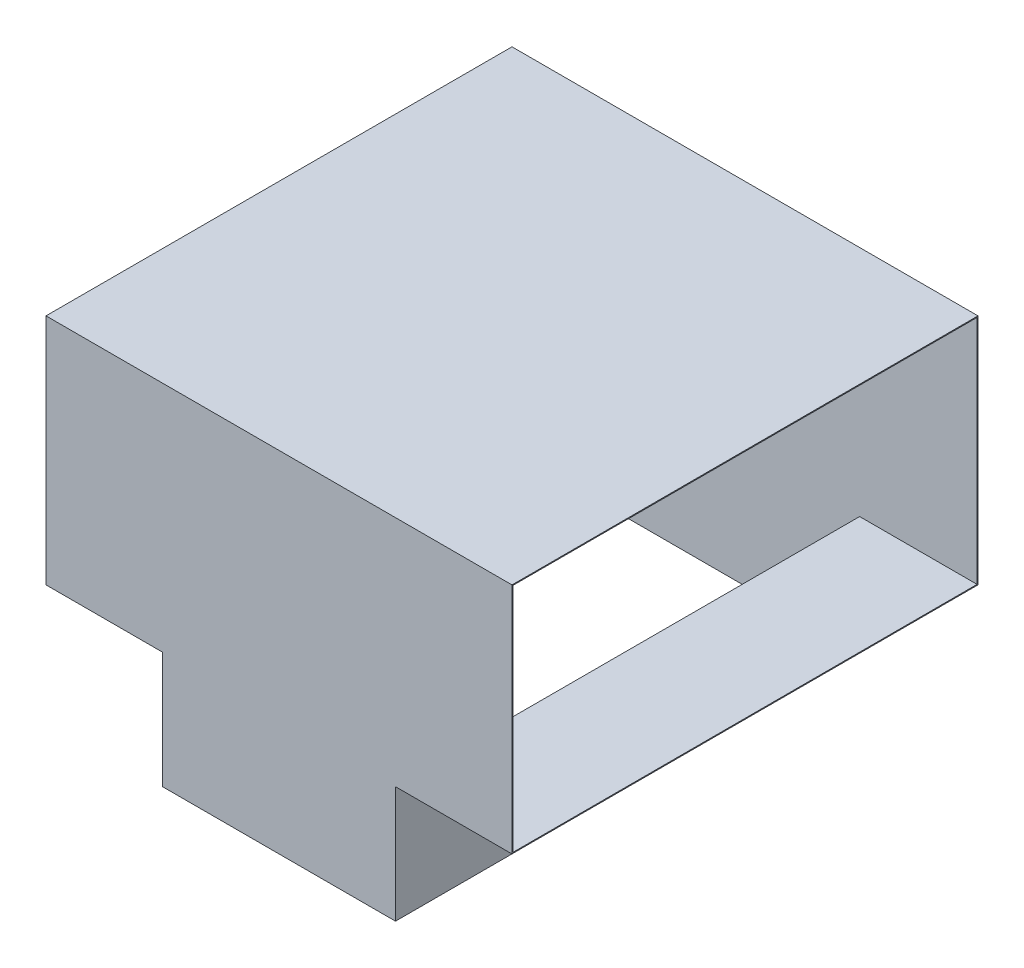
ISO-10303-21;
HEADER;
FILE_DESCRIPTION(('STEP AP214'),'2;1');
FILE_NAME('part.step','',(''),(''),'','','');
FILE_SCHEMA(('AUTOMOTIVE_DESIGN { 1 0 10303 214 1 1 1 1 }'));
ENDSEC;
DATA;
#1=APPLICATION_CONTEXT('core data for automotive mechanical design processes');
#2=APPLICATION_PROTOCOL_DEFINITION('international standard','automotive_design',2000,#1);
#3=PRODUCT_CONTEXT('',#1,'mechanical');
#4=PRODUCT('Part','Part','',(#3));
#5=PRODUCT_RELATED_PRODUCT_CATEGORY('part','',(#4));
#6=PRODUCT_DEFINITION_FORMATION('','',#4);
#7=PRODUCT_DEFINITION_CONTEXT('part definition',#1,'design');
#8=PRODUCT_DEFINITION('design','',#6,#7);
#9=PRODUCT_DEFINITION_SHAPE('','',#8);
#10=(LENGTH_UNIT() NAMED_UNIT(*) SI_UNIT(.MILLI.,.METRE.));
#11=(NAMED_UNIT(*) PLANE_ANGLE_UNIT() SI_UNIT($,.RADIAN.));
#12=(NAMED_UNIT(*) SI_UNIT($,.STERADIAN.) SOLID_ANGLE_UNIT());
#13=UNCERTAINTY_MEASURE_WITH_UNIT(LENGTH_MEASURE(1.E-05),#10,'distance_accuracy_value','');
#14=(GEOMETRIC_REPRESENTATION_CONTEXT(3) GLOBAL_UNCERTAINTY_ASSIGNED_CONTEXT((#13)) GLOBAL_UNIT_ASSIGNED_CONTEXT((#10,
#11,#12)) REPRESENTATION_CONTEXT('',''));
#15=CARTESIAN_POINT('',(0.,0.,0.));
#16=DIRECTION('',(0.,0.,1.));
#17=DIRECTION('',(1.,0.,0.));
#18=AXIS2_PLACEMENT_3D('',#15,#16,#17);
#19=CARTESIAN_POINT('',(500.,-248.,500.));
#20=DIRECTION('',(0.,1.,0.));
#21=DIRECTION('',(0.,0.,1.));
#22=AXIS2_PLACEMENT_3D('',#19,#20,#21);
#23=PLANE('',#22);
#24=DIRECTION('',(0.,0.,-1.));
#25=VECTOR('',#24,1.);
#26=CARTESIAN_POINT('',(-248.,-248.,498.));
#27=LINE('',#26,#25);
#28=CARTESIAN_POINT('',(-248.,-248.,498.));
#29=VERTEX_POINT('',#28);
#30=CARTESIAN_POINT('',(-248.,-248.,-498.));
#31=VERTEX_POINT('',#30);
#32=EDGE_CURVE('E214',#29,#31,#27,.T.);
#33=ORIENTED_EDGE('',*,*,#32,.T.);
#34=DIRECTION('',(-1.,0.,0.));
#35=VECTOR('',#34,1.);
#36=CARTESIAN_POINT('',(500.,-248.,-498.));
#37=LINE('',#36,#35);
#38=CARTESIAN_POINT('',(-500.,-248.,-498.));
#39=VERTEX_POINT('',#38);
#40=EDGE_CURVE('E334',#31,#39,#37,.T.);
#41=ORIENTED_EDGE('',*,*,#40,.T.);
#42=DIRECTION('',(0.,0.,-1.));
#43=VECTOR('',#42,1.);
#44=CARTESIAN_POINT('',(-500.,-248.,500.));
#45=LINE('',#44,#43);
#46=CARTESIAN_POINT('',(-500.,-248.,498.));
#47=VERTEX_POINT('',#46);
#48=EDGE_CURVE('E324',#47,#39,#45,.T.);
#49=ORIENTED_EDGE('',*,*,#48,.F.);
#50=DIRECTION('',(-1.,0.,0.));
#51=VECTOR('',#50,1.);
#52=CARTESIAN_POINT('',(500.,-248.,498.));
#53=LINE('',#52,#51);
#54=EDGE_CURVE('E221',#29,#47,#53,.T.);
#55=ORIENTED_EDGE('',*,*,#54,.F.);
#56=EDGE_LOOP('',(#33,#41,#49,#55));
#57=FACE_BOUND('',#56,.T.);
#58=ADVANCED_FACE('F82',(#57),#23,.T.);
#59=CARTESIAN_POINT('',(500.,-250.,500.));
#60=DIRECTION('',(0.,1.,0.));
#61=DIRECTION('',(0.,0.,1.));
#62=AXIS2_PLACEMENT_3D('',#59,#60,#61);
#63=PLANE('',#62);
#64=DIRECTION('',(0.,0.,-1.));
#65=VECTOR('',#64,1.);
#66=CARTESIAN_POINT('',(-250.,-250.,500.));
#67=LINE('',#66,#65);
#68=CARTESIAN_POINT('',(-250.,-250.,500.));
#69=VERTEX_POINT('',#68);
#70=CARTESIAN_POINT('',(-250.,-250.,-500.));
#71=VERTEX_POINT('',#70);
#72=EDGE_CURVE('E107',#69,#71,#67,.T.);
#73=ORIENTED_EDGE('',*,*,#72,.F.);
#74=DIRECTION('',(-1.,0.,0.));
#75=VECTOR('',#74,1.);
#76=CARTESIAN_POINT('',(500.,-250.,500.));
#77=LINE('',#76,#75);
#78=CARTESIAN_POINT('',(-500.,-250.,500.));
#79=VERTEX_POINT('',#78);
#80=EDGE_CURVE('E91',#69,#79,#77,.T.);
#81=ORIENTED_EDGE('',*,*,#80,.T.);
#82=DIRECTION('',(0.,0.,-1.));
#83=VECTOR('',#82,1.);
#84=CARTESIAN_POINT('',(-500.,-250.,500.));
#85=LINE('',#84,#83);
#86=CARTESIAN_POINT('',(-500.,-250.,-500.));
#87=VERTEX_POINT('',#86);
#88=EDGE_CURVE('E224',#79,#87,#85,.T.);
#89=ORIENTED_EDGE('',*,*,#88,.T.);
#90=DIRECTION('',(-1.,0.,0.));
#91=VECTOR('',#90,1.);
#92=CARTESIAN_POINT('',(500.,-250.,-500.));
#93=LINE('',#92,#91);
#94=EDGE_CURVE('E250',#71,#87,#93,.T.);
#95=ORIENTED_EDGE('',*,*,#94,.F.);
#96=EDGE_LOOP('',(#73,#81,#89,#95));
#97=FACE_BOUND('',#96,.T.);
#98=ADVANCED_FACE('F272',(#97),#63,.F.);
#99=DIRECTION('',(0.,0.,1.));
#100=VECTOR('',#99,1.);
#101=CARTESIAN_POINT('',(250.,-250.,500.));
#102=LINE('',#101,#100);
#103=CARTESIAN_POINT('',(250.,-250.,-500.));
#104=VERTEX_POINT('',#103);
#105=CARTESIAN_POINT('',(250.,-250.,500.));
#106=VERTEX_POINT('',#105);
#107=EDGE_CURVE('E292',#104,#106,#102,.T.);
#108=ORIENTED_EDGE('',*,*,#107,.F.);
#109=CARTESIAN_POINT('',(500.,-250.,-500.));
#110=VERTEX_POINT('',#109);
#111=EDGE_CURVE('E257',#110,#104,#93,.T.);
#112=ORIENTED_EDGE('',*,*,#111,.F.);
#113=DIRECTION('',(0.,0.,-1.));
#114=VECTOR('',#113,1.);
#115=CARTESIAN_POINT('',(500.,-250.,500.));
#116=LINE('',#115,#114);
#117=CARTESIAN_POINT('',(500.,-250.,500.));
#118=VERTEX_POINT('',#117);
#119=EDGE_CURVE('E232',#118,#110,#116,.T.);
#120=ORIENTED_EDGE('',*,*,#119,.F.);
#121=EDGE_CURVE('E12',#118,#106,#77,.T.);
#122=ORIENTED_EDGE('',*,*,#121,.T.);
#123=EDGE_LOOP('',(#108,#112,#120,#122));
#124=FACE_BOUND('',#123,.T.);
#125=ADVANCED_FACE('F290',(#124),#63,.F.);
#126=CARTESIAN_POINT('',(500.,0.,0.));
#127=DIRECTION('',(1.,0.,0.));
#128=DIRECTION('',(0.,0.,-1.));
#129=AXIS2_PLACEMENT_3D('',#126,#127,#128);
#130=PLANE('',#129);
#131=DIRECTION('',(0.,-1.,0.));
#132=VECTOR('',#131,1.);
#133=CARTESIAN_POINT('',(500.,250.,500.));
#134=LINE('',#133,#132);
#135=CARTESIAN_POINT('',(500.,250.,500.));
#136=VERTEX_POINT('',#135);
#137=EDGE_CURVE('E229',#136,#118,#134,.T.);
#138=ORIENTED_EDGE('',*,*,#137,.T.);
#139=ORIENTED_EDGE('',*,*,#119,.T.);
#140=DIRECTION('',(0.,1.,0.));
#141=VECTOR('',#140,1.);
#142=CARTESIAN_POINT('',(500.,250.,-500.));
#143=LINE('',#142,#141);
#144=CARTESIAN_POINT('',(500.,250.,-500.));
#145=VERTEX_POINT('',#144);
#146=EDGE_CURVE('E235',#110,#145,#143,.T.);
#147=ORIENTED_EDGE('',*,*,#146,.T.);
#148=DIRECTION('',(0.,0.,1.));
#149=VECTOR('',#148,1.);
#150=CARTESIAN_POINT('',(500.,250.,500.));
#151=LINE('',#150,#149);
#152=EDGE_CURVE('E237',#145,#136,#151,.T.);
#153=ORIENTED_EDGE('',*,*,#152,.T.);
#154=EDGE_LOOP('',(#138,#139,#147,#153));
#155=FACE_BOUND('',#154,.T.);
#156=DIRECTION('',(0.,0.,-1.));
#157=VECTOR('',#156,1.);
#158=CARTESIAN_POINT('',(500.,-248.,500.));
#159=LINE('',#158,#157);
#160=CARTESIAN_POINT('',(500.,-248.,498.));
#161=VERTEX_POINT('',#160);
#162=CARTESIAN_POINT('',(500.,-248.,-498.));
#163=VERTEX_POINT('',#162);
#164=EDGE_CURVE('E312',#161,#163,#159,.T.);
#165=ORIENTED_EDGE('',*,*,#164,.F.);
#166=DIRECTION('',(0.,-1.,0.));
#167=VECTOR('',#166,1.);
#168=CARTESIAN_POINT('',(500.,250.,498.));
#169=LINE('',#168,#167);
#170=CARTESIAN_POINT('',(500.,248.,498.));
#171=VERTEX_POINT('',#170);
#172=EDGE_CURVE('E219',#171,#161,#169,.T.);
#173=ORIENTED_EDGE('',*,*,#172,.F.);
#174=DIRECTION('',(0.,0.,1.));
#175=VECTOR('',#174,1.);
#176=CARTESIAN_POINT('',(500.,248.,500.));
#177=LINE('',#176,#175);
#178=CARTESIAN_POINT('',(500.,248.,-498.));
#179=VERTEX_POINT('',#178);
#180=EDGE_CURVE('E318',#179,#171,#177,.T.);
#181=ORIENTED_EDGE('',*,*,#180,.F.);
#182=DIRECTION('',(0.,1.,0.));
#183=VECTOR('',#182,1.);
#184=CARTESIAN_POINT('',(500.,250.,-498.));
#185=LINE('',#184,#183);
#186=EDGE_CURVE('E315',#163,#179,#185,.T.);
#187=ORIENTED_EDGE('',*,*,#186,.F.);
#188=EDGE_LOOP('',(#165,#173,#181,#187));
#189=FACE_BOUND('',#188,.T.);
#190=ADVANCED_FACE('F287',(#155,#189),#130,.T.);
#191=CARTESIAN_POINT('',(-500.,0.,0.));
#192=DIRECTION('',(1.,0.,0.));
#193=DIRECTION('',(0.,0.,-1.));
#194=AXIS2_PLACEMENT_3D('',#191,#192,#193);
#195=PLANE('',#194);
#196=DIRECTION('',(0.,-1.,0.));
#197=VECTOR('',#196,1.);
#198=CARTESIAN_POINT('',(-500.,250.,500.));
#199=LINE('',#198,#197);
#200=CARTESIAN_POINT('',(-500.,250.,500.));
#201=VERTEX_POINT('',#200);
#202=EDGE_CURVE('E220',#201,#79,#199,.T.);
#203=ORIENTED_EDGE('',*,*,#202,.F.);
#204=DIRECTION('',(0.,0.,1.));
#205=VECTOR('',#204,1.);
#206=CARTESIAN_POINT('',(-500.,250.,500.));
#207=LINE('',#206,#205);
#208=CARTESIAN_POINT('',(-500.,250.,-500.));
#209=VERTEX_POINT('',#208);
#210=EDGE_CURVE('E233',#209,#201,#207,.T.);
#211=ORIENTED_EDGE('',*,*,#210,.F.);
#212=DIRECTION('',(0.,1.,0.));
#213=VECTOR('',#212,1.);
#214=CARTESIAN_POINT('',(-500.,250.,-500.));
#215=LINE('',#214,#213);
#216=EDGE_CURVE('E242',#87,#209,#215,.T.);
#217=ORIENTED_EDGE('',*,*,#216,.F.);
#218=ORIENTED_EDGE('',*,*,#88,.F.);
#219=EDGE_LOOP('',(#203,#211,#217,#218));
#220=FACE_BOUND('',#219,.T.);
#221=DIRECTION('',(0.,-1.,0.));
#222=VECTOR('',#221,1.);
#223=CARTESIAN_POINT('',(-500.,250.,498.));
#224=LINE('',#223,#222);
#225=CARTESIAN_POINT('',(-500.,248.,498.));
#226=VERTEX_POINT('',#225);
#227=EDGE_CURVE('E321',#226,#47,#224,.T.);
#228=ORIENTED_EDGE('',*,*,#227,.T.);
#229=ORIENTED_EDGE('',*,*,#48,.T.);
#230=DIRECTION('',(0.,1.,0.));
#231=VECTOR('',#230,1.);
#232=CARTESIAN_POINT('',(-500.,250.,-498.));
#233=LINE('',#232,#231);
#234=CARTESIAN_POINT('',(-500.,248.,-498.));
#235=VERTEX_POINT('',#234);
#236=EDGE_CURVE('E327',#39,#235,#233,.T.);
#237=ORIENTED_EDGE('',*,*,#236,.T.);
#238=DIRECTION('',(0.,0.,1.));
#239=VECTOR('',#238,1.);
#240=CARTESIAN_POINT('',(-500.,248.,500.));
#241=LINE('',#240,#239);
#242=EDGE_CURVE('E313',#235,#226,#241,.T.);
#243=ORIENTED_EDGE('',*,*,#242,.T.);
#244=EDGE_LOOP('',(#228,#229,#237,#243));
#245=FACE_BOUND('',#244,.T.);
#246=ADVANCED_FACE('F276',(#220,#245),#195,.F.);
#247=CARTESIAN_POINT('',(500.,250.,500.));
#248=DIRECTION('',(0.,0.,-1.));
#249=DIRECTION('',(0.,1.,0.));
#250=AXIS2_PLACEMENT_3D('',#247,#248,#249);
#251=PLANE('',#250);
#252=ORIENTED_EDGE('',*,*,#202,.T.);
#253=ORIENTED_EDGE('',*,*,#80,.F.);
#254=DIRECTION('',(0.,1.,0.));
#255=VECTOR('',#254,1.);
#256=CARTESIAN_POINT('',(-250.,-500.,500.));
#257=LINE('',#256,#255);
#258=CARTESIAN_POINT('',(-250.,-500.,500.));
#259=VERTEX_POINT('',#258);
#260=EDGE_CURVE('E520',#259,#69,#257,.T.);
#261=ORIENTED_EDGE('',*,*,#260,.F.);
#262=DIRECTION('',(-1.,0.,0.));
#263=VECTOR('',#262,1.);
#264=CARTESIAN_POINT('',(-250.,-500.,500.));
#265=LINE('',#264,#263);
#266=CARTESIAN_POINT('',(250.,-500.,500.));
#267=VERTEX_POINT('',#266);
#268=EDGE_CURVE('E519',#267,#259,#265,.T.);
#269=ORIENTED_EDGE('',*,*,#268,.F.);
#270=DIRECTION('',(0.,1.,0.));
#271=VECTOR('',#270,1.);
#272=CARTESIAN_POINT('',(250.,-500.,500.));
#273=LINE('',#272,#271);
#274=EDGE_CURVE('E304',#267,#106,#273,.T.);
#275=ORIENTED_EDGE('',*,*,#274,.T.);
#276=ORIENTED_EDGE('',*,*,#121,.F.);
#277=ORIENTED_EDGE('',*,*,#137,.F.);
#278=DIRECTION('',(-1.,0.,0.));
#279=VECTOR('',#278,1.);
#280=CARTESIAN_POINT('',(500.,250.,500.));
#281=LINE('',#280,#279);
#282=EDGE_CURVE('E238',#136,#201,#281,.T.);
#283=ORIENTED_EDGE('',*,*,#282,.T.);
#284=EDGE_LOOP('',(#252,#253,#261,#269,#275,#276,#277,#283));
#285=FACE_BOUND('',#284,.T.);
#286=ADVANCED_FACE('F84',(#285),#251,.F.);
#287=CARTESIAN_POINT('',(500.,250.,-500.));
#288=DIRECTION('',(0.,0.,1.));
#289=DIRECTION('',(0.,-1.,0.));
#290=AXIS2_PLACEMENT_3D('',#287,#288,#289);
#291=PLANE('',#290);
#292=ORIENTED_EDGE('',*,*,#216,.T.);
#293=DIRECTION('',(-1.,0.,0.));
#294=VECTOR('',#293,1.);
#295=CARTESIAN_POINT('',(500.,250.,-500.));
#296=LINE('',#295,#294);
#297=EDGE_CURVE('E247',#145,#209,#296,.T.);
#298=ORIENTED_EDGE('',*,*,#297,.F.);
#299=ORIENTED_EDGE('',*,*,#146,.F.);
#300=ORIENTED_EDGE('',*,*,#111,.T.);
#301=DIRECTION('',(0.,1.,0.));
#302=VECTOR('',#301,1.);
#303=CARTESIAN_POINT('',(250.,-500.,-500.));
#304=LINE('',#303,#302);
#305=CARTESIAN_POINT('',(250.,-500.,-500.));
#306=VERTEX_POINT('',#305);
#307=EDGE_CURVE('E525',#306,#104,#304,.T.);
#308=ORIENTED_EDGE('',*,*,#307,.F.);
#309=DIRECTION('',(1.,0.,0.));
#310=VECTOR('',#309,1.);
#311=CARTESIAN_POINT('',(-250.,-500.,-500.));
#312=LINE('',#311,#310);
#313=CARTESIAN_POINT('',(-250.,-500.,-500.));
#314=VERTEX_POINT('',#313);
#315=EDGE_CURVE('E298',#314,#306,#312,.T.);
#316=ORIENTED_EDGE('',*,*,#315,.F.);
#317=DIRECTION('',(0.,1.,0.));
#318=VECTOR('',#317,1.);
#319=CARTESIAN_POINT('',(-250.,-500.,-500.));
#320=LINE('',#319,#318);
#321=EDGE_CURVE('E270',#314,#71,#320,.T.);
#322=ORIENTED_EDGE('',*,*,#321,.T.);
#323=ORIENTED_EDGE('',*,*,#94,.T.);
#324=EDGE_LOOP('',(#292,#298,#299,#300,#308,#316,#322,#323));
#325=FACE_BOUND('',#324,.T.);
#326=ADVANCED_FACE('F266',(#325),#291,.F.);
#327=CARTESIAN_POINT('',(500.,250.,500.));
#328=DIRECTION('',(0.,-1.,0.));
#329=DIRECTION('',(0.,0.,-1.));
#330=AXIS2_PLACEMENT_3D('',#327,#328,#329);
#331=PLANE('',#330);
#332=ORIENTED_EDGE('',*,*,#210,.T.);
#333=ORIENTED_EDGE('',*,*,#282,.F.);
#334=ORIENTED_EDGE('',*,*,#152,.F.);
#335=ORIENTED_EDGE('',*,*,#297,.T.);
#336=EDGE_LOOP('',(#332,#333,#334,#335));
#337=FACE_BOUND('',#336,.T.);
#338=ADVANCED_FACE('F280',(#337),#331,.F.);
#339=CARTESIAN_POINT('',(500.,250.,498.));
#340=DIRECTION('',(0.,0.,-1.));
#341=DIRECTION('',(0.,1.,0.));
#342=AXIS2_PLACEMENT_3D('',#339,#340,#341);
#343=PLANE('',#342);
#344=ORIENTED_EDGE('',*,*,#227,.F.);
#345=DIRECTION('',(-1.,0.,0.));
#346=VECTOR('',#345,1.);
#347=CARTESIAN_POINT('',(500.,248.,498.));
#348=LINE('',#347,#346);
#349=EDGE_CURVE('E320',#171,#226,#348,.T.);
#350=ORIENTED_EDGE('',*,*,#349,.F.);
#351=ORIENTED_EDGE('',*,*,#172,.T.);
#352=CARTESIAN_POINT('',(248.,-248.,498.));
#353=VERTEX_POINT('',#352);
#354=EDGE_CURVE('E211',#161,#353,#53,.T.);
#355=ORIENTED_EDGE('',*,*,#354,.T.);
#356=DIRECTION('',(0.,1.,0.));
#357=VECTOR('',#356,1.);
#358=CARTESIAN_POINT('',(248.,-500.,498.));
#359=LINE('',#358,#357);
#360=CARTESIAN_POINT('',(248.,-500.,498.));
#361=VERTEX_POINT('',#360);
#362=EDGE_CURVE('E196',#361,#353,#359,.T.);
#363=ORIENTED_EDGE('',*,*,#362,.F.);
#364=DIRECTION('',(-1.,0.,0.));
#365=VECTOR('',#364,1.);
#366=CARTESIAN_POINT('',(-250.,-500.,498.));
#367=LINE('',#366,#365);
#368=CARTESIAN_POINT('',(-248.,-500.,498.));
#369=VERTEX_POINT('',#368);
#370=EDGE_CURVE('E537',#361,#369,#367,.T.);
#371=ORIENTED_EDGE('',*,*,#370,.T.);
#372=DIRECTION('',(0.,1.,0.));
#373=VECTOR('',#372,1.);
#374=CARTESIAN_POINT('',(-248.,-500.,498.));
#375=LINE('',#374,#373);
#376=EDGE_CURVE('E206',#369,#29,#375,.T.);
#377=ORIENTED_EDGE('',*,*,#376,.T.);
#378=ORIENTED_EDGE('',*,*,#54,.T.);
#379=EDGE_LOOP('',(#344,#350,#351,#355,#363,#371,#377,#378));
#380=FACE_BOUND('',#379,.T.);
#381=ADVANCED_FACE('F216',(#380),#343,.T.);
#382=DIRECTION('',(0.,0.,1.));
#383=VECTOR('',#382,1.);
#384=CARTESIAN_POINT('',(248.,-248.,-498.));
#385=LINE('',#384,#383);
#386=CARTESIAN_POINT('',(248.,-248.,-498.));
#387=VERTEX_POINT('',#386);
#388=EDGE_CURVE('E199',#387,#353,#385,.T.);
#389=ORIENTED_EDGE('',*,*,#388,.T.);
#390=ORIENTED_EDGE('',*,*,#354,.F.);
#391=ORIENTED_EDGE('',*,*,#164,.T.);
#392=EDGE_CURVE('E213',#163,#387,#37,.T.);
#393=ORIENTED_EDGE('',*,*,#392,.T.);
#394=EDGE_LOOP('',(#389,#390,#391,#393));
#395=FACE_BOUND('',#394,.T.);
#396=ADVANCED_FACE('F210',(#395),#23,.T.);
#397=CARTESIAN_POINT('',(500.,250.,-498.));
#398=DIRECTION('',(0.,0.,1.));
#399=DIRECTION('',(0.,-1.,0.));
#400=AXIS2_PLACEMENT_3D('',#397,#398,#399);
#401=PLANE('',#400);
#402=ORIENTED_EDGE('',*,*,#236,.F.);
#403=ORIENTED_EDGE('',*,*,#40,.F.);
#404=DIRECTION('',(0.,1.,0.));
#405=VECTOR('',#404,1.);
#406=CARTESIAN_POINT('',(-248.,-500.,-498.));
#407=LINE('',#406,#405);
#408=CARTESIAN_POINT('',(-248.,-500.,-498.));
#409=VERTEX_POINT('',#408);
#410=EDGE_CURVE('E300',#409,#31,#407,.T.);
#411=ORIENTED_EDGE('',*,*,#410,.F.);
#412=DIRECTION('',(1.,0.,0.));
#413=VECTOR('',#412,1.);
#414=CARTESIAN_POINT('',(-250.,-500.,-498.));
#415=LINE('',#414,#413);
#416=CARTESIAN_POINT('',(248.,-500.,-498.));
#417=VERTEX_POINT('',#416);
#418=EDGE_CURVE('E535',#409,#417,#415,.T.);
#419=ORIENTED_EDGE('',*,*,#418,.T.);
#420=DIRECTION('',(0.,1.,0.));
#421=VECTOR('',#420,1.);
#422=CARTESIAN_POINT('',(248.,-500.,-498.));
#423=LINE('',#422,#421);
#424=EDGE_CURVE('E99',#417,#387,#423,.T.);
#425=ORIENTED_EDGE('',*,*,#424,.T.);
#426=ORIENTED_EDGE('',*,*,#392,.F.);
#427=ORIENTED_EDGE('',*,*,#186,.T.);
#428=DIRECTION('',(-1.,0.,0.));
#429=VECTOR('',#428,1.);
#430=CARTESIAN_POINT('',(500.,248.,-498.));
#431=LINE('',#430,#429);
#432=EDGE_CURVE('E333',#179,#235,#431,.T.);
#433=ORIENTED_EDGE('',*,*,#432,.T.);
#434=EDGE_LOOP('',(#402,#403,#411,#419,#425,#426,#427,#433));
#435=FACE_BOUND('',#434,.T.);
#436=ADVANCED_FACE('F344',(#435),#401,.T.);
#437=CARTESIAN_POINT('',(500.,248.,500.));
#438=DIRECTION('',(0.,-1.,0.));
#439=DIRECTION('',(0.,0.,-1.));
#440=AXIS2_PLACEMENT_3D('',#437,#438,#439);
#441=PLANE('',#440);
#442=ORIENTED_EDGE('',*,*,#242,.F.);
#443=ORIENTED_EDGE('',*,*,#432,.F.);
#444=ORIENTED_EDGE('',*,*,#180,.T.);
#445=ORIENTED_EDGE('',*,*,#349,.T.);
#446=EDGE_LOOP('',(#442,#443,#444,#445));
#447=FACE_BOUND('',#446,.T.);
#448=ADVANCED_FACE('F346',(#447),#441,.T.);
#449=CARTESIAN_POINT('',(0.,-500.,0.));
#450=DIRECTION('',(0.,-1.,0.));
#451=DIRECTION('',(0.,0.,-1.));
#452=AXIS2_PLACEMENT_3D('',#449,#450,#451);
#453=PLANE('',#452);
#454=DIRECTION('',(0.,0.,-1.));
#455=VECTOR('',#454,1.);
#456=CARTESIAN_POINT('',(-250.,-500.,500.));
#457=LINE('',#456,#455);
#458=EDGE_CURVE('E295',#259,#314,#457,.T.);
#459=ORIENTED_EDGE('',*,*,#458,.T.);
#460=ORIENTED_EDGE('',*,*,#315,.T.);
#461=DIRECTION('',(0.,0.,1.));
#462=VECTOR('',#461,1.);
#463=CARTESIAN_POINT('',(250.,-500.,500.));
#464=LINE('',#463,#462);
#465=EDGE_CURVE('E518',#306,#267,#464,.T.);
#466=ORIENTED_EDGE('',*,*,#465,.T.);
#467=ORIENTED_EDGE('',*,*,#268,.T.);
#468=EDGE_LOOP('',(#459,#460,#466,#467));
#469=FACE_BOUND('',#468,.T.);
#470=ORIENTED_EDGE('',*,*,#418,.F.);
#471=DIRECTION('',(0.,0.,-1.));
#472=VECTOR('',#471,1.);
#473=CARTESIAN_POINT('',(-248.,-500.,500.));
#474=LINE('',#473,#472);
#475=EDGE_CURVE('E512',#369,#409,#474,.T.);
#476=ORIENTED_EDGE('',*,*,#475,.F.);
#477=ORIENTED_EDGE('',*,*,#370,.F.);
#478=DIRECTION('',(0.,0.,1.));
#479=VECTOR('',#478,1.);
#480=CARTESIAN_POINT('',(248.,-500.,500.));
#481=LINE('',#480,#479);
#482=EDGE_CURVE('E202',#417,#361,#481,.T.);
#483=ORIENTED_EDGE('',*,*,#482,.F.);
#484=EDGE_LOOP('',(#470,#476,#477,#483));
#485=FACE_BOUND('',#484,.T.);
#486=ADVANCED_FACE('F404',(#469,#485),#453,.T.);
#487=CARTESIAN_POINT('',(-250.,-500.,500.));
#488=DIRECTION('',(1.,0.,0.));
#489=DIRECTION('',(0.,0.,-1.));
#490=AXIS2_PLACEMENT_3D('',#487,#488,#489);
#491=PLANE('',#490);
#492=ORIENTED_EDGE('',*,*,#72,.T.);
#493=ORIENTED_EDGE('',*,*,#321,.F.);
#494=ORIENTED_EDGE('',*,*,#458,.F.);
#495=ORIENTED_EDGE('',*,*,#260,.T.);
#496=EDGE_LOOP('',(#492,#493,#494,#495));
#497=FACE_BOUND('',#496,.T.);
#498=ADVANCED_FACE('F436',(#497),#491,.F.);
#499=CARTESIAN_POINT('',(250.,-500.,500.));
#500=DIRECTION('',(-1.,0.,0.));
#501=DIRECTION('',(0.,0.,1.));
#502=AXIS2_PLACEMENT_3D('',#499,#500,#501);
#503=PLANE('',#502);
#504=ORIENTED_EDGE('',*,*,#107,.T.);
#505=ORIENTED_EDGE('',*,*,#274,.F.);
#506=ORIENTED_EDGE('',*,*,#465,.F.);
#507=ORIENTED_EDGE('',*,*,#307,.T.);
#508=EDGE_LOOP('',(#504,#505,#506,#507));
#509=FACE_BOUND('',#508,.T.);
#510=ADVANCED_FACE('F445',(#509),#503,.F.);
#511=CARTESIAN_POINT('',(-248.,-500.,500.));
#512=DIRECTION('',(1.,0.,0.));
#513=DIRECTION('',(0.,0.,-1.));
#514=AXIS2_PLACEMENT_3D('',#511,#512,#513);
#515=PLANE('',#514);
#516=ORIENTED_EDGE('',*,*,#410,.T.);
#517=ORIENTED_EDGE('',*,*,#32,.F.);
#518=ORIENTED_EDGE('',*,*,#376,.F.);
#519=ORIENTED_EDGE('',*,*,#475,.T.);
#520=EDGE_LOOP('',(#516,#517,#518,#519));
#521=FACE_BOUND('',#520,.T.);
#522=ADVANCED_FACE('F454',(#521),#515,.T.);
#523=CARTESIAN_POINT('',(248.,-500.,500.));
#524=DIRECTION('',(-1.,0.,0.));
#525=DIRECTION('',(0.,0.,1.));
#526=AXIS2_PLACEMENT_3D('',#523,#524,#525);
#527=PLANE('',#526);
#528=ORIENTED_EDGE('',*,*,#362,.T.);
#529=ORIENTED_EDGE('',*,*,#388,.F.);
#530=ORIENTED_EDGE('',*,*,#424,.F.);
#531=ORIENTED_EDGE('',*,*,#482,.T.);
#532=EDGE_LOOP('',(#528,#529,#530,#531));
#533=FACE_BOUND('',#532,.T.);
#534=ADVANCED_FACE('F198',(#533),#527,.T.);
#535=CLOSED_SHELL('',(#58,#98,#125,#190,#246,#286,#326,#338,#381,#396,#436,#448,#486,#498,#510,
#522,#534));
#536=MANIFOLD_SOLID_BREP('B2',#535);
#537=ADVANCED_BREP_SHAPE_REPRESENTATION('',(#18,#536),#14);
#538=SHAPE_DEFINITION_REPRESENTATION(#9,#537);
ENDSEC;
END-ISO-10303-21;
